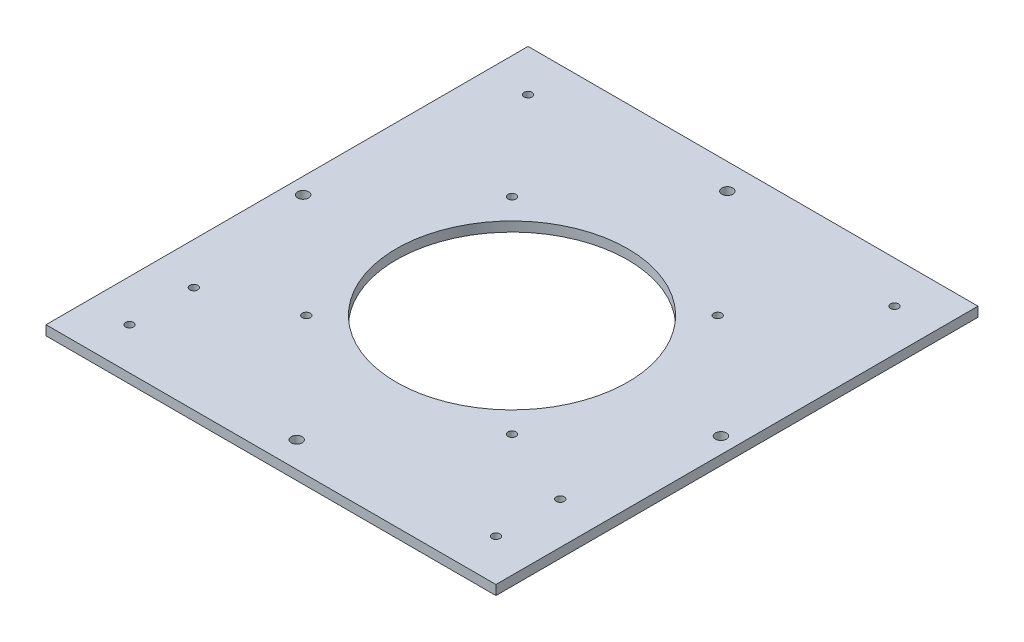
ISO-10303-21;
HEADER;
FILE_DESCRIPTION(('STEP AP214'),'2;1');
FILE_NAME('part.step','',(''),(''),'','','');
FILE_SCHEMA(('AUTOMOTIVE_DESIGN { 1 0 10303 214 1 1 1 1 }'));
ENDSEC;
DATA;
#1=APPLICATION_CONTEXT('core data for automotive mechanical design processes');
#2=APPLICATION_PROTOCOL_DEFINITION('international standard','automotive_design',2000,#1);
#3=PRODUCT_CONTEXT('',#1,'mechanical');
#4=PRODUCT('Part','Part','',(#3));
#5=PRODUCT_RELATED_PRODUCT_CATEGORY('part','',(#4));
#6=PRODUCT_DEFINITION_FORMATION('','',#4);
#7=PRODUCT_DEFINITION_CONTEXT('part definition',#1,'design');
#8=PRODUCT_DEFINITION('design','',#6,#7);
#9=PRODUCT_DEFINITION_SHAPE('','',#8);
#10=(LENGTH_UNIT() NAMED_UNIT(*) SI_UNIT(.MILLI.,.METRE.));
#11=(NAMED_UNIT(*) PLANE_ANGLE_UNIT() SI_UNIT($,.RADIAN.));
#12=(NAMED_UNIT(*) SI_UNIT($,.STERADIAN.) SOLID_ANGLE_UNIT());
#13=UNCERTAINTY_MEASURE_WITH_UNIT(LENGTH_MEASURE(1.E-05),#10,'distance_accuracy_value','');
#14=(GEOMETRIC_REPRESENTATION_CONTEXT(3) GLOBAL_UNCERTAINTY_ASSIGNED_CONTEXT((#13)) GLOBAL_UNIT_ASSIGNED_CONTEXT((#10,
#11,#12)) REPRESENTATION_CONTEXT('',''));
#15=CARTESIAN_POINT('',(0.,0.,0.));
#16=DIRECTION('',(0.,0.,1.));
#17=DIRECTION('',(1.,0.,0.));
#18=AXIS2_PLACEMENT_3D('',#15,#16,#17);
#19=CARTESIAN_POINT('',(12.,224.057982809084,290.032139168121));
#20=DIRECTION('',(0.,1.,0.));
#21=DIRECTION('',(0.,0.,1.));
#22=AXIS2_PLACEMENT_3D('',#19,#20,#21);
#23=PLANE('',#22);
#24=CARTESIAN_POINT('',(139.,224.057982809084,137.));
#25=DIRECTION('',(0.,-1.,0.));
#26=DIRECTION('',(0.,0.,-1.));
#27=AXIS2_PLACEMENT_3D('',#24,#25,#26);
#28=CIRCLE('',#27,1.25);
#29=CARTESIAN_POINT('',(139.,224.057982809084,135.75));
#30=VERTEX_POINT('',#29);
#31=EDGE_CURVE('E148',#30,#30,#28,.T.);
#32=ORIENTED_EDGE('',*,*,#31,.F.);
#33=EDGE_LOOP('',(#32));
#34=FACE_BOUND('',#33,.T.);
#35=CARTESIAN_POINT('',(139.,224.057982809084,117.));
#36=DIRECTION('',(0.,-1.,0.));
#37=DIRECTION('',(0.,0.,-1.));
#38=AXIS2_PLACEMENT_3D('',#35,#36,#37);
#39=CIRCLE('',#38,1.25);
#40=CARTESIAN_POINT('',(139.,224.057982809084,115.75));
#41=VERTEX_POINT('',#40);
#42=EDGE_CURVE('E152',#41,#41,#39,.T.);
#43=ORIENTED_EDGE('',*,*,#42,.F.);
#44=EDGE_LOOP('',(#43));
#45=FACE_BOUND('',#44,.T.);
#46=CARTESIAN_POINT('',(139.,224.057982809084,13.));
#47=DIRECTION('',(0.,-1.,0.));
#48=DIRECTION('',(0.,0.,-1.));
#49=AXIS2_PLACEMENT_3D('',#46,#47,#48);
#50=CIRCLE('',#49,1.25);
#51=CARTESIAN_POINT('',(139.,224.057982809084,11.75));
#52=VERTEX_POINT('',#51);
#53=EDGE_CURVE('E156',#52,#52,#50,.T.);
#54=ORIENTED_EDGE('',*,*,#53,.F.);
#55=EDGE_LOOP('',(#54));
#56=FACE_BOUND('',#55,.T.);
#57=CARTESIAN_POINT('',(25.,224.057982809084,137.));
#58=DIRECTION('',(0.,-1.,0.));
#59=DIRECTION('',(0.,0.,-1.));
#60=AXIS2_PLACEMENT_3D('',#57,#58,#59);
#61=CIRCLE('',#60,1.25);
#62=CARTESIAN_POINT('',(25.,224.057982809084,135.75));
#63=VERTEX_POINT('',#62);
#64=EDGE_CURVE('E160',#63,#63,#61,.T.);
#65=ORIENTED_EDGE('',*,*,#64,.F.);
#66=EDGE_LOOP('',(#65));
#67=FACE_BOUND('',#66,.T.);
#68=CARTESIAN_POINT('',(25.,224.057982809084,117.));
#69=DIRECTION('',(0.,-1.,0.));
#70=DIRECTION('',(0.,0.,-1.));
#71=AXIS2_PLACEMENT_3D('',#68,#69,#70);
#72=CIRCLE('',#71,1.25);
#73=CARTESIAN_POINT('',(25.,224.057982809084,115.75));
#74=VERTEX_POINT('',#73);
#75=EDGE_CURVE('E164',#74,#74,#72,.T.);
#76=ORIENTED_EDGE('',*,*,#75,.F.);
#77=EDGE_LOOP('',(#76));
#78=FACE_BOUND('',#77,.T.);
#79=CARTESIAN_POINT('',(25.,224.057982809084,13.));
#80=DIRECTION('',(0.,-1.,0.));
#81=DIRECTION('',(0.,0.,-1.));
#82=AXIS2_PLACEMENT_3D('',#79,#80,#81);
#83=CIRCLE('',#82,1.25);
#84=CARTESIAN_POINT('',(25.,224.057982809084,11.75));
#85=VERTEX_POINT('',#84);
#86=EDGE_CURVE('E168',#85,#85,#83,.T.);
#87=ORIENTED_EDGE('',*,*,#86,.F.);
#88=EDGE_LOOP('',(#87));
#89=FACE_BOUND('',#88,.T.);
#90=CARTESIAN_POINT('',(82.,224.057982809084,142.));
#91=DIRECTION('',(0.,-1.,0.));
#92=DIRECTION('',(0.,0.,-1.));
#93=AXIS2_PLACEMENT_3D('',#90,#91,#92);
#94=CIRCLE('',#93,1.69999999999999);
#95=CARTESIAN_POINT('',(82.,224.057982809084,140.3));
#96=VERTEX_POINT('',#95);
#97=EDGE_CURVE('E172',#96,#96,#94,.T.);
#98=ORIENTED_EDGE('',*,*,#97,.F.);
#99=EDGE_LOOP('',(#98));
#100=FACE_BOUND('',#99,.T.);
#101=CARTESIAN_POINT('',(82.,224.057982809084,7.99999999999998));
#102=DIRECTION('',(0.,-1.,0.));
#103=DIRECTION('',(0.,0.,-1.));
#104=AXIS2_PLACEMENT_3D('',#101,#102,#103);
#105=CIRCLE('',#104,1.69999999999999);
#106=CARTESIAN_POINT('',(82.,224.057982809084,6.29999999999999));
#107=VERTEX_POINT('',#106);
#108=EDGE_CURVE('E176',#107,#107,#105,.T.);
#109=ORIENTED_EDGE('',*,*,#108,.F.);
#110=EDGE_LOOP('',(#109));
#111=FACE_BOUND('',#110,.T.);
#112=CARTESIAN_POINT('',(17.,224.057982809084,75.));
#113=DIRECTION('',(0.,-1.,0.));
#114=DIRECTION('',(0.,0.,-1.));
#115=AXIS2_PLACEMENT_3D('',#112,#113,#114);
#116=CIRCLE('',#115,1.7);
#117=CARTESIAN_POINT('',(17.,224.057982809084,73.3));
#118=VERTEX_POINT('',#117);
#119=EDGE_CURVE('E180',#118,#118,#116,.T.);
#120=ORIENTED_EDGE('',*,*,#119,.F.);
#121=EDGE_LOOP('',(#120));
#122=FACE_BOUND('',#121,.T.);
#123=CARTESIAN_POINT('',(50.,224.057982809084,43.));
#124=DIRECTION('',(0.,-1.,0.));
#125=DIRECTION('',(0.,0.,-1.));
#126=AXIS2_PLACEMENT_3D('',#123,#124,#125);
#127=CIRCLE('',#126,1.24999999999999);
#128=CARTESIAN_POINT('',(50.,224.057982809084,41.75));
#129=VERTEX_POINT('',#128);
#130=EDGE_CURVE('E184',#129,#129,#127,.T.);
#131=ORIENTED_EDGE('',*,*,#130,.F.);
#132=EDGE_LOOP('',(#131));
#133=FACE_BOUND('',#132,.T.);
#134=CARTESIAN_POINT('',(114.,224.057982809084,107.));
#135=DIRECTION('',(0.,-1.,0.));
#136=DIRECTION('',(0.,0.,-1.));
#137=AXIS2_PLACEMENT_3D('',#134,#135,#136);
#138=CIRCLE('',#137,1.24999999999999);
#139=CARTESIAN_POINT('',(114.,224.057982809084,105.75));
#140=VERTEX_POINT('',#139);
#141=EDGE_CURVE('E188',#140,#140,#138,.T.);
#142=ORIENTED_EDGE('',*,*,#141,.F.);
#143=EDGE_LOOP('',(#142));
#144=FACE_BOUND('',#143,.T.);
#145=CARTESIAN_POINT('',(82.,224.057982809084,75.));
#146=DIRECTION('',(0.,-1.,0.));
#147=DIRECTION('',(0.,0.,-1.));
#148=AXIS2_PLACEMENT_3D('',#145,#146,#147);
#149=CIRCLE('',#148,36.);
#150=CARTESIAN_POINT('',(82.,224.057982809084,39.));
#151=VERTEX_POINT('',#150);
#152=EDGE_CURVE('E97',#151,#151,#149,.T.);
#153=ORIENTED_EDGE('',*,*,#152,.F.);
#154=EDGE_LOOP('',(#153));
#155=FACE_BOUND('',#154,.T.);
#156=DIRECTION('',(0.,0.,-1.));
#157=VECTOR('',#156,1.);
#158=CARTESIAN_POINT('',(152.,224.057982809084,290.032139168121));
#159=LINE('',#158,#157);
#160=CARTESIAN_POINT('',(152.,224.057982809084,150.));
#161=VERTEX_POINT('',#160);
#162=CARTESIAN_POINT('',(152.,224.057982809084,0.));
#163=VERTEX_POINT('',#162);
#164=EDGE_CURVE('E77',#161,#163,#159,.T.);
#165=ORIENTED_EDGE('',*,*,#164,.F.);
#166=DIRECTION('',(-1.,0.,0.));
#167=VECTOR('',#166,1.);
#168=CARTESIAN_POINT('',(12.,224.057982809084,150.));
#169=LINE('',#168,#167);
#170=CARTESIAN_POINT('',(12.,224.057982809084,150.));
#171=VERTEX_POINT('',#170);
#172=EDGE_CURVE('E47',#161,#171,#169,.T.);
#173=ORIENTED_EDGE('',*,*,#172,.T.);
#174=DIRECTION('',(0.,0.,-1.));
#175=VECTOR('',#174,1.);
#176=CARTESIAN_POINT('',(12.,224.057982809084,290.032139168121));
#177=LINE('',#176,#175);
#178=CARTESIAN_POINT('',(12.,224.057982809084,0.));
#179=VERTEX_POINT('',#178);
#180=EDGE_CURVE('E92',#171,#179,#177,.T.);
#181=ORIENTED_EDGE('',*,*,#180,.T.);
#182=DIRECTION('',(1.,0.,0.));
#183=VECTOR('',#182,1.);
#184=CARTESIAN_POINT('',(12.,224.057982809084,0.));
#185=LINE('',#184,#183);
#186=EDGE_CURVE('E89',#179,#163,#185,.T.);
#187=ORIENTED_EDGE('',*,*,#186,.T.);
#188=EDGE_LOOP('',(#165,#173,#181,#187));
#189=FACE_BOUND('',#188,.T.);
#190=CARTESIAN_POINT('',(114.,224.057982809084,43.));
#191=DIRECTION('',(0.,-1.,0.));
#192=DIRECTION('',(0.,0.,-1.));
#193=AXIS2_PLACEMENT_3D('',#190,#191,#192);
#194=CIRCLE('',#193,1.24999999999999);
#195=CARTESIAN_POINT('',(114.,224.057982809084,41.75));
#196=VERTEX_POINT('',#195);
#197=EDGE_CURVE('E206',#196,#196,#194,.T.);
#198=ORIENTED_EDGE('',*,*,#197,.F.);
#199=EDGE_LOOP('',(#198));
#200=FACE_BOUND('',#199,.T.);
#201=CARTESIAN_POINT('',(50.,224.057982809084,107.));
#202=DIRECTION('',(0.,-1.,0.));
#203=DIRECTION('',(0.,0.,-1.));
#204=AXIS2_PLACEMENT_3D('',#201,#202,#203);
#205=CIRCLE('',#204,1.24999999999999);
#206=CARTESIAN_POINT('',(50.,224.057982809084,105.75));
#207=VERTEX_POINT('',#206);
#208=EDGE_CURVE('E220',#207,#207,#205,.T.);
#209=ORIENTED_EDGE('',*,*,#208,.F.);
#210=EDGE_LOOP('',(#209));
#211=FACE_BOUND('',#210,.T.);
#212=CARTESIAN_POINT('',(147.,224.057982809084,75.));
#213=DIRECTION('',(0.,-1.,0.));
#214=DIRECTION('',(0.,0.,-1.));
#215=AXIS2_PLACEMENT_3D('',#212,#213,#214);
#216=CIRCLE('',#215,1.70000000000001);
#217=CARTESIAN_POINT('',(147.,224.057982809084,73.3));
#218=VERTEX_POINT('',#217);
#219=EDGE_CURVE('E240',#218,#218,#216,.T.);
#220=ORIENTED_EDGE('',*,*,#219,.F.);
#221=EDGE_LOOP('',(#220));
#222=FACE_BOUND('',#221,.T.);
#223=ADVANCED_FACE('F39',(#34,#45,#56,#67,#78,#89,#100,#111,#122,#133,#144,#155,#189,#200,#211,
#222),#23,.F.);
#224=CARTESIAN_POINT('',(152.,227.057982809084,290.032139168121));
#225=DIRECTION('',(1.,0.,0.));
#226=DIRECTION('',(0.,0.,-1.));
#227=AXIS2_PLACEMENT_3D('',#224,#225,#226);
#228=PLANE('',#227);
#229=DIRECTION('',(0.,1.,0.));
#230=VECTOR('',#229,1.);
#231=CARTESIAN_POINT('',(152.,227.057982809084,150.));
#232=LINE('',#231,#230);
#233=CARTESIAN_POINT('',(152.,227.057982809084,150.));
#234=VERTEX_POINT('',#233);
#235=EDGE_CURVE('E54',#161,#234,#232,.T.);
#236=ORIENTED_EDGE('',*,*,#235,.F.);
#237=ORIENTED_EDGE('',*,*,#164,.T.);
#238=DIRECTION('',(0.,-1.,0.));
#239=VECTOR('',#238,1.);
#240=CARTESIAN_POINT('',(152.,227.057982809084,0.));
#241=LINE('',#240,#239);
#242=CARTESIAN_POINT('',(152.,227.057982809084,0.));
#243=VERTEX_POINT('',#242);
#244=EDGE_CURVE('E82',#243,#163,#241,.T.);
#245=ORIENTED_EDGE('',*,*,#244,.F.);
#246=DIRECTION('',(0.,0.,-1.));
#247=VECTOR('',#246,1.);
#248=CARTESIAN_POINT('',(152.,227.057982809084,290.032139168121));
#249=LINE('',#248,#247);
#250=EDGE_CURVE('E87',#234,#243,#249,.T.);
#251=ORIENTED_EDGE('',*,*,#250,.F.);
#252=EDGE_LOOP('',(#236,#237,#245,#251));
#253=FACE_BOUND('',#252,.T.);
#254=ADVANCED_FACE('F79',(#253),#228,.T.);
#255=CARTESIAN_POINT('',(12.,227.057982809084,290.032139168121));
#256=DIRECTION('',(0.,1.,0.));
#257=DIRECTION('',(0.,0.,1.));
#258=AXIS2_PLACEMENT_3D('',#255,#256,#257);
#259=PLANE('',#258);
#260=CARTESIAN_POINT('',(139.,227.057982809084,137.));
#261=DIRECTION('',(0.,-1.,0.));
#262=DIRECTION('',(0.,0.,-1.));
#263=AXIS2_PLACEMENT_3D('',#260,#261,#262);
#264=CIRCLE('',#263,1.25);
#265=CARTESIAN_POINT('',(139.,227.057982809084,135.75));
#266=VERTEX_POINT('',#265);
#267=EDGE_CURVE('E280',#266,#266,#264,.T.);
#268=ORIENTED_EDGE('',*,*,#267,.T.);
#269=EDGE_LOOP('',(#268));
#270=FACE_BOUND('',#269,.T.);
#271=CARTESIAN_POINT('',(139.,227.057982809084,117.));
#272=DIRECTION('',(0.,-1.,0.));
#273=DIRECTION('',(0.,0.,-1.));
#274=AXIS2_PLACEMENT_3D('',#271,#272,#273);
#275=CIRCLE('',#274,1.25);
#276=CARTESIAN_POINT('',(139.,227.057982809084,115.75));
#277=VERTEX_POINT('',#276);
#278=EDGE_CURVE('E274',#277,#277,#275,.T.);
#279=ORIENTED_EDGE('',*,*,#278,.T.);
#280=EDGE_LOOP('',(#279));
#281=FACE_BOUND('',#280,.T.);
#282=CARTESIAN_POINT('',(139.,227.057982809084,13.));
#283=DIRECTION('',(0.,-1.,0.));
#284=DIRECTION('',(0.,0.,-1.));
#285=AXIS2_PLACEMENT_3D('',#282,#283,#284);
#286=CIRCLE('',#285,1.25);
#287=CARTESIAN_POINT('',(139.,227.057982809084,11.75));
#288=VERTEX_POINT('',#287);
#289=EDGE_CURVE('E268',#288,#288,#286,.T.);
#290=ORIENTED_EDGE('',*,*,#289,.T.);
#291=EDGE_LOOP('',(#290));
#292=FACE_BOUND('',#291,.T.);
#293=CARTESIAN_POINT('',(25.,227.057982809084,137.));
#294=DIRECTION('',(0.,-1.,0.));
#295=DIRECTION('',(0.,0.,-1.));
#296=AXIS2_PLACEMENT_3D('',#293,#294,#295);
#297=CIRCLE('',#296,1.25);
#298=CARTESIAN_POINT('',(25.,227.057982809084,135.75));
#299=VERTEX_POINT('',#298);
#300=EDGE_CURVE('E262',#299,#299,#297,.T.);
#301=ORIENTED_EDGE('',*,*,#300,.T.);
#302=EDGE_LOOP('',(#301));
#303=FACE_BOUND('',#302,.T.);
#304=CARTESIAN_POINT('',(25.,227.057982809084,117.));
#305=DIRECTION('',(0.,-1.,0.));
#306=DIRECTION('',(0.,0.,-1.));
#307=AXIS2_PLACEMENT_3D('',#304,#305,#306);
#308=CIRCLE('',#307,1.25);
#309=CARTESIAN_POINT('',(25.,227.057982809084,115.75));
#310=VERTEX_POINT('',#309);
#311=EDGE_CURVE('E256',#310,#310,#308,.T.);
#312=ORIENTED_EDGE('',*,*,#311,.T.);
#313=EDGE_LOOP('',(#312));
#314=FACE_BOUND('',#313,.T.);
#315=CARTESIAN_POINT('',(25.,227.057982809084,13.));
#316=DIRECTION('',(0.,-1.,0.));
#317=DIRECTION('',(0.,0.,-1.));
#318=AXIS2_PLACEMENT_3D('',#315,#316,#317);
#319=CIRCLE('',#318,1.25);
#320=CARTESIAN_POINT('',(25.,227.057982809084,11.75));
#321=VERTEX_POINT('',#320);
#322=EDGE_CURVE('E250',#321,#321,#319,.T.);
#323=ORIENTED_EDGE('',*,*,#322,.T.);
#324=EDGE_LOOP('',(#323));
#325=FACE_BOUND('',#324,.T.);
#326=CARTESIAN_POINT('',(82.,227.057982809084,142.));
#327=DIRECTION('',(0.,-1.,0.));
#328=DIRECTION('',(0.,0.,-1.));
#329=AXIS2_PLACEMENT_3D('',#326,#327,#328);
#330=CIRCLE('',#329,1.69999999999999);
#331=CARTESIAN_POINT('',(82.,227.057982809084,140.3));
#332=VERTEX_POINT('',#331);
#333=EDGE_CURVE('E244',#332,#332,#330,.T.);
#334=ORIENTED_EDGE('',*,*,#333,.T.);
#335=EDGE_LOOP('',(#334));
#336=FACE_BOUND('',#335,.T.);
#337=CARTESIAN_POINT('',(147.,227.057982809084,75.));
#338=DIRECTION('',(0.,-1.,0.));
#339=DIRECTION('',(0.,0.,-1.));
#340=AXIS2_PLACEMENT_3D('',#337,#338,#339);
#341=CIRCLE('',#340,1.70000000000001);
#342=CARTESIAN_POINT('',(147.,227.057982809084,73.3));
#343=VERTEX_POINT('',#342);
#344=EDGE_CURVE('E236',#343,#343,#341,.T.);
#345=ORIENTED_EDGE('',*,*,#344,.T.);
#346=EDGE_LOOP('',(#345));
#347=FACE_BOUND('',#346,.T.);
#348=CARTESIAN_POINT('',(82.,227.057982809084,7.99999999999998));
#349=DIRECTION('',(0.,-1.,0.));
#350=DIRECTION('',(0.,0.,-1.));
#351=AXIS2_PLACEMENT_3D('',#348,#349,#350);
#352=CIRCLE('',#351,1.69999999999999);
#353=CARTESIAN_POINT('',(82.,227.057982809084,6.29999999999999));
#354=VERTEX_POINT('',#353);
#355=EDGE_CURVE('E230',#354,#354,#352,.T.);
#356=ORIENTED_EDGE('',*,*,#355,.T.);
#357=EDGE_LOOP('',(#356));
#358=FACE_BOUND('',#357,.T.);
#359=CARTESIAN_POINT('',(17.,227.057982809084,75.));
#360=DIRECTION('',(0.,-1.,0.));
#361=DIRECTION('',(0.,0.,-1.));
#362=AXIS2_PLACEMENT_3D('',#359,#360,#361);
#363=CIRCLE('',#362,1.7);
#364=CARTESIAN_POINT('',(17.,227.057982809084,73.3));
#365=VERTEX_POINT('',#364);
#366=EDGE_CURVE('E224',#365,#365,#363,.T.);
#367=ORIENTED_EDGE('',*,*,#366,.T.);
#368=EDGE_LOOP('',(#367));
#369=FACE_BOUND('',#368,.T.);
#370=CARTESIAN_POINT('',(50.,227.057982809084,107.));
#371=DIRECTION('',(0.,-1.,0.));
#372=DIRECTION('',(0.,0.,-1.));
#373=AXIS2_PLACEMENT_3D('',#370,#371,#372);
#374=CIRCLE('',#373,1.25);
#375=CARTESIAN_POINT('',(50.,227.057982809084,105.75));
#376=VERTEX_POINT('',#375);
#377=EDGE_CURVE('E216',#376,#376,#374,.T.);
#378=ORIENTED_EDGE('',*,*,#377,.T.);
#379=EDGE_LOOP('',(#378));
#380=FACE_BOUND('',#379,.T.);
#381=CARTESIAN_POINT('',(50.,227.057982809084,43.));
#382=DIRECTION('',(0.,-1.,0.));
#383=DIRECTION('',(0.,0.,-1.));
#384=AXIS2_PLACEMENT_3D('',#381,#382,#383);
#385=CIRCLE('',#384,1.25);
#386=CARTESIAN_POINT('',(50.,227.057982809084,41.75));
#387=VERTEX_POINT('',#386);
#388=EDGE_CURVE('E210',#387,#387,#385,.T.);
#389=ORIENTED_EDGE('',*,*,#388,.T.);
#390=EDGE_LOOP('',(#389));
#391=FACE_BOUND('',#390,.T.);
#392=CARTESIAN_POINT('',(114.,227.057982809084,43.));
#393=DIRECTION('',(0.,-1.,0.));
#394=DIRECTION('',(0.,0.,-1.));
#395=AXIS2_PLACEMENT_3D('',#392,#393,#394);
#396=CIRCLE('',#395,1.25);
#397=CARTESIAN_POINT('',(114.,227.057982809084,41.75));
#398=VERTEX_POINT('',#397);
#399=EDGE_CURVE('E202',#398,#398,#396,.T.);
#400=ORIENTED_EDGE('',*,*,#399,.T.);
#401=EDGE_LOOP('',(#400));
#402=FACE_BOUND('',#401,.T.);
#403=CARTESIAN_POINT('',(114.,227.057982809084,107.));
#404=DIRECTION('',(0.,-1.,0.));
#405=DIRECTION('',(0.,0.,-1.));
#406=AXIS2_PLACEMENT_3D('',#403,#404,#405);
#407=CIRCLE('',#406,1.25);
#408=CARTESIAN_POINT('',(114.,227.057982809084,105.75));
#409=VERTEX_POINT('',#408);
#410=EDGE_CURVE('E195',#409,#409,#407,.T.);
#411=ORIENTED_EDGE('',*,*,#410,.T.);
#412=EDGE_LOOP('',(#411));
#413=FACE_BOUND('',#412,.T.);
#414=CARTESIAN_POINT('',(82.,227.057982809084,75.));
#415=DIRECTION('',(0.,1.,0.));
#416=DIRECTION('',(0.,0.,1.));
#417=AXIS2_PLACEMENT_3D('',#414,#415,#416);
#418=CIRCLE('',#417,36.);
#419=CARTESIAN_POINT('',(82.,227.057982809084,111.));
#420=VERTEX_POINT('',#419);
#421=EDGE_CURVE('E125',#420,#420,#418,.F.);
#422=ORIENTED_EDGE('',*,*,#421,.T.);
#423=EDGE_LOOP('',(#422));
#424=FACE_BOUND('',#423,.T.);
#425=DIRECTION('',(-1.,0.,0.));
#426=VECTOR('',#425,1.);
#427=CARTESIAN_POINT('',(12.,227.057982809084,150.));
#428=LINE('',#427,#426);
#429=CARTESIAN_POINT('',(12.,227.057982809084,150.));
#430=VERTEX_POINT('',#429);
#431=EDGE_CURVE('E86',#234,#430,#428,.T.);
#432=ORIENTED_EDGE('',*,*,#431,.F.);
#433=ORIENTED_EDGE('',*,*,#250,.T.);
#434=DIRECTION('',(1.,0.,0.));
#435=VECTOR('',#434,1.);
#436=CARTESIAN_POINT('',(12.,227.057982809084,0.));
#437=LINE('',#436,#435);
#438=CARTESIAN_POINT('',(12.,227.057982809084,0.));
#439=VERTEX_POINT('',#438);
#440=EDGE_CURVE('E101',#439,#243,#437,.T.);
#441=ORIENTED_EDGE('',*,*,#440,.F.);
#442=DIRECTION('',(0.,0.,-1.));
#443=VECTOR('',#442,1.);
#444=CARTESIAN_POINT('',(12.,227.057982809084,290.032139168121));
#445=LINE('',#444,#443);
#446=EDGE_CURVE('E113',#430,#439,#445,.T.);
#447=ORIENTED_EDGE('',*,*,#446,.F.);
#448=EDGE_LOOP('',(#432,#433,#441,#447));
#449=FACE_BOUND('',#448,.T.);
#450=ADVANCED_FACE('F118',(#270,#281,#292,#303,#314,#325,#336,#347,#358,#369,#380,#391,#402,
#413,#424,#449),#259,.T.);
#451=CARTESIAN_POINT('',(12.,224.057982809084,290.032139168121));
#452=DIRECTION('',(-1.,0.,0.));
#453=DIRECTION('',(0.,0.,1.));
#454=AXIS2_PLACEMENT_3D('',#451,#452,#453);
#455=PLANE('',#454);
#456=DIRECTION('',(0.,-1.,0.));
#457=VECTOR('',#456,1.);
#458=CARTESIAN_POINT('',(12.,224.057982809084,150.));
#459=LINE('',#458,#457);
#460=EDGE_CURVE('E11',#430,#171,#459,.T.);
#461=ORIENTED_EDGE('',*,*,#460,.F.);
#462=ORIENTED_EDGE('',*,*,#446,.T.);
#463=DIRECTION('',(0.,1.,0.));
#464=VECTOR('',#463,1.);
#465=CARTESIAN_POINT('',(12.,224.057982809084,0.));
#466=LINE('',#465,#464);
#467=EDGE_CURVE('E105',#179,#439,#466,.T.);
#468=ORIENTED_EDGE('',*,*,#467,.F.);
#469=ORIENTED_EDGE('',*,*,#180,.F.);
#470=EDGE_LOOP('',(#461,#462,#468,#469));
#471=FACE_BOUND('',#470,.T.);
#472=ADVANCED_FACE('F129',(#471),#455,.T.);
#473=CARTESIAN_POINT('',(0.,0.,0.));
#474=DIRECTION('',(0.,0.,-1.));
#475=DIRECTION('',(-1.,0.,0.));
#476=AXIS2_PLACEMENT_3D('',#473,#474,#475);
#477=PLANE('',#476);
#478=ORIENTED_EDGE('',*,*,#186,.F.);
#479=ORIENTED_EDGE('',*,*,#467,.T.);
#480=ORIENTED_EDGE('',*,*,#440,.T.);
#481=ORIENTED_EDGE('',*,*,#244,.T.);
#482=EDGE_LOOP('',(#478,#479,#480,#481));
#483=FACE_BOUND('',#482,.T.);
#484=ADVANCED_FACE('F99',(#483),#477,.T.);
#485=CARTESIAN_POINT('',(0.,0.,150.));
#486=DIRECTION('',(0.,0.,-1.));
#487=DIRECTION('',(-1.,0.,0.));
#488=AXIS2_PLACEMENT_3D('',#485,#486,#487);
#489=PLANE('',#488);
#490=ORIENTED_EDGE('',*,*,#235,.T.);
#491=ORIENTED_EDGE('',*,*,#431,.T.);
#492=ORIENTED_EDGE('',*,*,#460,.T.);
#493=ORIENTED_EDGE('',*,*,#172,.F.);
#494=EDGE_LOOP('',(#490,#491,#492,#493));
#495=FACE_BOUND('',#494,.T.);
#496=ADVANCED_FACE('F136',(#495),#489,.F.);
#497=CARTESIAN_POINT('',(82.,227.058982809084,75.));
#498=DIRECTION('',(0.,-1.,0.));
#499=DIRECTION('',(0.,0.,-1.));
#500=AXIS2_PLACEMENT_3D('',#497,#498,#499);
#501=CYLINDRICAL_SURFACE('',#500,36.);
#502=ORIENTED_EDGE('',*,*,#421,.F.);
#503=EDGE_LOOP('',(#502));
#504=FACE_BOUND('',#503,.T.);
#505=ORIENTED_EDGE('',*,*,#152,.T.);
#506=EDGE_LOOP('',(#505));
#507=FACE_BOUND('',#506,.T.);
#508=ADVANCED_FACE('F345',(#504,#507),#501,.F.);
#509=CARTESIAN_POINT('',(114.,224.057982809084,107.));
#510=DIRECTION('',(0.,-1.,0.));
#511=DIRECTION('',(0.,0.,-1.));
#512=AXIS2_PLACEMENT_3D('',#509,#510,#511);
#513=CYLINDRICAL_SURFACE('',#512,1.24999999999999);
#514=ORIENTED_EDGE('',*,*,#410,.F.);
#515=EDGE_LOOP('',(#514));
#516=FACE_BOUND('',#515,.T.);
#517=ORIENTED_EDGE('',*,*,#141,.T.);
#518=EDGE_LOOP('',(#517));
#519=FACE_BOUND('',#518,.T.);
#520=ADVANCED_FACE('F341',(#516,#519),#513,.F.);
#521=CARTESIAN_POINT('',(114.,224.057982809084,43.));
#522=DIRECTION('',(0.,-1.,0.));
#523=DIRECTION('',(0.,0.,-1.));
#524=AXIS2_PLACEMENT_3D('',#521,#522,#523);
#525=CYLINDRICAL_SURFACE('',#524,1.24999999999999);
#526=ORIENTED_EDGE('',*,*,#399,.F.);
#527=EDGE_LOOP('',(#526));
#528=FACE_BOUND('',#527,.T.);
#529=ORIENTED_EDGE('',*,*,#197,.T.);
#530=EDGE_LOOP('',(#529));
#531=FACE_BOUND('',#530,.T.);
#532=ADVANCED_FACE('F337',(#528,#531),#525,.F.);
#533=CARTESIAN_POINT('',(50.,224.057982809084,43.));
#534=DIRECTION('',(0.,-1.,0.));
#535=DIRECTION('',(0.,0.,-1.));
#536=AXIS2_PLACEMENT_3D('',#533,#534,#535);
#537=CYLINDRICAL_SURFACE('',#536,1.24999999999999);
#538=ORIENTED_EDGE('',*,*,#388,.F.);
#539=EDGE_LOOP('',(#538));
#540=FACE_BOUND('',#539,.T.);
#541=ORIENTED_EDGE('',*,*,#130,.T.);
#542=EDGE_LOOP('',(#541));
#543=FACE_BOUND('',#542,.T.);
#544=ADVANCED_FACE('F333',(#540,#543),#537,.F.);
#545=CARTESIAN_POINT('',(50.,224.057982809084,107.));
#546=DIRECTION('',(0.,-1.,0.));
#547=DIRECTION('',(0.,0.,-1.));
#548=AXIS2_PLACEMENT_3D('',#545,#546,#547);
#549=CYLINDRICAL_SURFACE('',#548,1.24999999999999);
#550=ORIENTED_EDGE('',*,*,#377,.F.);
#551=EDGE_LOOP('',(#550));
#552=FACE_BOUND('',#551,.T.);
#553=ORIENTED_EDGE('',*,*,#208,.T.);
#554=EDGE_LOOP('',(#553));
#555=FACE_BOUND('',#554,.T.);
#556=ADVANCED_FACE('F329',(#552,#555),#549,.F.);
#557=CARTESIAN_POINT('',(17.,224.057982809084,75.));
#558=DIRECTION('',(0.,-1.,0.));
#559=DIRECTION('',(0.,0.,-1.));
#560=AXIS2_PLACEMENT_3D('',#557,#558,#559);
#561=CYLINDRICAL_SURFACE('',#560,1.7);
#562=ORIENTED_EDGE('',*,*,#366,.F.);
#563=EDGE_LOOP('',(#562));
#564=FACE_BOUND('',#563,.T.);
#565=ORIENTED_EDGE('',*,*,#119,.T.);
#566=EDGE_LOOP('',(#565));
#567=FACE_BOUND('',#566,.T.);
#568=ADVANCED_FACE('F325',(#564,#567),#561,.F.);
#569=CARTESIAN_POINT('',(82.,224.057982809084,7.99999999999998));
#570=DIRECTION('',(0.,-1.,0.));
#571=DIRECTION('',(0.,0.,-1.));
#572=AXIS2_PLACEMENT_3D('',#569,#570,#571);
#573=CYLINDRICAL_SURFACE('',#572,1.69999999999999);
#574=ORIENTED_EDGE('',*,*,#355,.F.);
#575=EDGE_LOOP('',(#574));
#576=FACE_BOUND('',#575,.T.);
#577=ORIENTED_EDGE('',*,*,#108,.T.);
#578=EDGE_LOOP('',(#577));
#579=FACE_BOUND('',#578,.T.);
#580=ADVANCED_FACE('F321',(#576,#579),#573,.F.);
#581=CARTESIAN_POINT('',(147.,224.057982809084,75.));
#582=DIRECTION('',(0.,-1.,0.));
#583=DIRECTION('',(0.,0.,-1.));
#584=AXIS2_PLACEMENT_3D('',#581,#582,#583);
#585=CYLINDRICAL_SURFACE('',#584,1.70000000000001);
#586=ORIENTED_EDGE('',*,*,#344,.F.);
#587=EDGE_LOOP('',(#586));
#588=FACE_BOUND('',#587,.T.);
#589=ORIENTED_EDGE('',*,*,#219,.T.);
#590=EDGE_LOOP('',(#589));
#591=FACE_BOUND('',#590,.T.);
#592=ADVANCED_FACE('F317',(#588,#591),#585,.F.);
#593=CARTESIAN_POINT('',(82.,224.057982809084,142.));
#594=DIRECTION('',(0.,-1.,0.));
#595=DIRECTION('',(0.,0.,-1.));
#596=AXIS2_PLACEMENT_3D('',#593,#594,#595);
#597=CYLINDRICAL_SURFACE('',#596,1.69999999999999);
#598=ORIENTED_EDGE('',*,*,#333,.F.);
#599=EDGE_LOOP('',(#598));
#600=FACE_BOUND('',#599,.T.);
#601=ORIENTED_EDGE('',*,*,#97,.T.);
#602=EDGE_LOOP('',(#601));
#603=FACE_BOUND('',#602,.T.);
#604=ADVANCED_FACE('F313',(#600,#603),#597,.F.);
#605=CARTESIAN_POINT('',(25.,224.057982809084,13.));
#606=DIRECTION('',(0.,-1.,0.));
#607=DIRECTION('',(0.,0.,-1.));
#608=AXIS2_PLACEMENT_3D('',#605,#606,#607);
#609=CYLINDRICAL_SURFACE('',#608,1.25);
#610=ORIENTED_EDGE('',*,*,#322,.F.);
#611=EDGE_LOOP('',(#610));
#612=FACE_BOUND('',#611,.T.);
#613=ORIENTED_EDGE('',*,*,#86,.T.);
#614=EDGE_LOOP('',(#613));
#615=FACE_BOUND('',#614,.T.);
#616=ADVANCED_FACE('F309',(#612,#615),#609,.F.);
#617=CARTESIAN_POINT('',(25.,224.057982809084,117.));
#618=DIRECTION('',(0.,-1.,0.));
#619=DIRECTION('',(0.,0.,-1.));
#620=AXIS2_PLACEMENT_3D('',#617,#618,#619);
#621=CYLINDRICAL_SURFACE('',#620,1.25);
#622=ORIENTED_EDGE('',*,*,#311,.F.);
#623=EDGE_LOOP('',(#622));
#624=FACE_BOUND('',#623,.T.);
#625=ORIENTED_EDGE('',*,*,#75,.T.);
#626=EDGE_LOOP('',(#625));
#627=FACE_BOUND('',#626,.T.);
#628=ADVANCED_FACE('F305',(#624,#627),#621,.F.);
#629=CARTESIAN_POINT('',(25.,224.057982809084,137.));
#630=DIRECTION('',(0.,-1.,0.));
#631=DIRECTION('',(0.,0.,-1.));
#632=AXIS2_PLACEMENT_3D('',#629,#630,#631);
#633=CYLINDRICAL_SURFACE('',#632,1.25);
#634=ORIENTED_EDGE('',*,*,#300,.F.);
#635=EDGE_LOOP('',(#634));
#636=FACE_BOUND('',#635,.T.);
#637=ORIENTED_EDGE('',*,*,#64,.T.);
#638=EDGE_LOOP('',(#637));
#639=FACE_BOUND('',#638,.T.);
#640=ADVANCED_FACE('F301',(#636,#639),#633,.F.);
#641=CARTESIAN_POINT('',(139.,224.057982809084,13.));
#642=DIRECTION('',(0.,-1.,0.));
#643=DIRECTION('',(0.,0.,-1.));
#644=AXIS2_PLACEMENT_3D('',#641,#642,#643);
#645=CYLINDRICAL_SURFACE('',#644,1.25);
#646=ORIENTED_EDGE('',*,*,#289,.F.);
#647=EDGE_LOOP('',(#646));
#648=FACE_BOUND('',#647,.T.);
#649=ORIENTED_EDGE('',*,*,#53,.T.);
#650=EDGE_LOOP('',(#649));
#651=FACE_BOUND('',#650,.T.);
#652=ADVANCED_FACE('F294',(#648,#651),#645,.F.);
#653=CARTESIAN_POINT('',(139.,224.057982809084,117.));
#654=DIRECTION('',(0.,-1.,0.));
#655=DIRECTION('',(0.,0.,-1.));
#656=AXIS2_PLACEMENT_3D('',#653,#654,#655);
#657=CYLINDRICAL_SURFACE('',#656,1.25);
#658=ORIENTED_EDGE('',*,*,#278,.F.);
#659=EDGE_LOOP('',(#658));
#660=FACE_BOUND('',#659,.T.);
#661=ORIENTED_EDGE('',*,*,#42,.T.);
#662=EDGE_LOOP('',(#661));
#663=FACE_BOUND('',#662,.T.);
#664=ADVANCED_FACE('F288',(#660,#663),#657,.F.);
#665=CARTESIAN_POINT('',(139.,224.057982809084,137.));
#666=DIRECTION('',(0.,-1.,0.));
#667=DIRECTION('',(0.,0.,-1.));
#668=AXIS2_PLACEMENT_3D('',#665,#666,#667);
#669=CYLINDRICAL_SURFACE('',#668,1.25);
#670=ORIENTED_EDGE('',*,*,#267,.F.);
#671=EDGE_LOOP('',(#670));
#672=FACE_BOUND('',#671,.T.);
#673=ORIENTED_EDGE('',*,*,#31,.T.);
#674=EDGE_LOOP('',(#673));
#675=FACE_BOUND('',#674,.T.);
#676=ADVANCED_FACE('F286',(#672,#675),#669,.F.);
#677=CLOSED_SHELL('',(#223,#254,#450,#472,#484,#496,#508,#520,#532,#544,#556,#568,#580,#592,
#604,#616,#628,#640,#652,#664,#676));
#678=MANIFOLD_SOLID_BREP('B2',#677);
#679=ADVANCED_BREP_SHAPE_REPRESENTATION('',(#18,#678),#14);
#680=SHAPE_DEFINITION_REPRESENTATION(#9,#679);
ENDSEC;
END-ISO-10303-21;
